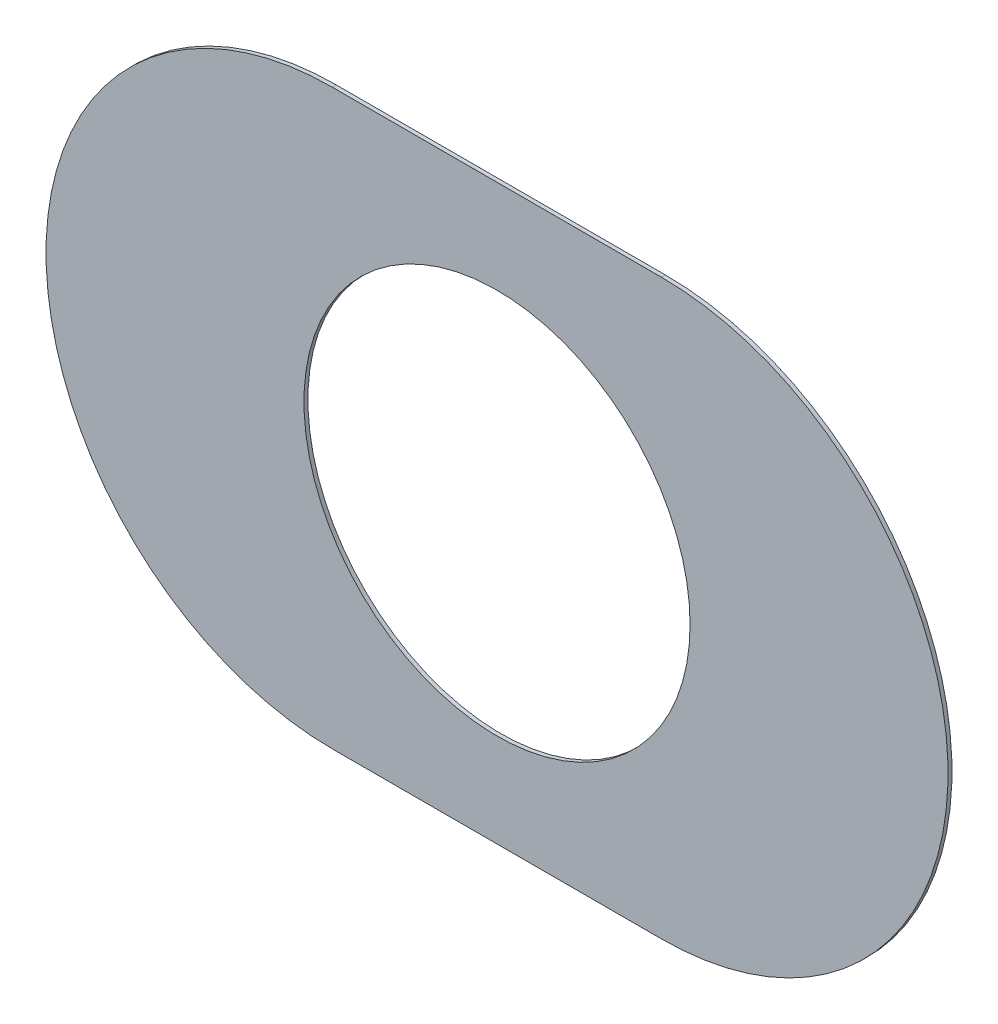
ISO-10303-21;
HEADER;
FILE_DESCRIPTION(('STEP AP214'),'2;1');
FILE_NAME('part.step','',(''),(''),'','','');
FILE_SCHEMA(('AUTOMOTIVE_DESIGN { 1 0 10303 214 1 1 1 1 }'));
ENDSEC;
DATA;
#1=APPLICATION_CONTEXT('core data for automotive mechanical design processes');
#2=APPLICATION_PROTOCOL_DEFINITION('international standard','automotive_design',2000,#1);
#3=PRODUCT_CONTEXT('',#1,'mechanical');
#4=PRODUCT('Part','Part','',(#3));
#5=PRODUCT_RELATED_PRODUCT_CATEGORY('part','',(#4));
#6=PRODUCT_DEFINITION_FORMATION('','',#4);
#7=PRODUCT_DEFINITION_CONTEXT('part definition',#1,'design');
#8=PRODUCT_DEFINITION('design','',#6,#7);
#9=PRODUCT_DEFINITION_SHAPE('','',#8);
#10=(LENGTH_UNIT() NAMED_UNIT(*) SI_UNIT(.MILLI.,.METRE.));
#11=(NAMED_UNIT(*) PLANE_ANGLE_UNIT() SI_UNIT($,.RADIAN.));
#12=(NAMED_UNIT(*) SI_UNIT($,.STERADIAN.) SOLID_ANGLE_UNIT());
#13=UNCERTAINTY_MEASURE_WITH_UNIT(LENGTH_MEASURE(1.E-05),#10,'distance_accuracy_value','');
#14=(GEOMETRIC_REPRESENTATION_CONTEXT(3) GLOBAL_UNCERTAINTY_ASSIGNED_CONTEXT((#13)) GLOBAL_UNIT_ASSIGNED_CONTEXT((#10,
#11,#12)) REPRESENTATION_CONTEXT('',''));
#15=CARTESIAN_POINT('',(0.,0.,0.));
#16=DIRECTION('',(0.,0.,1.));
#17=DIRECTION('',(1.,0.,0.));
#18=AXIS2_PLACEMENT_3D('',#15,#16,#17);
#19=CARTESIAN_POINT('',(24.3000003427268,19.6200006854535,0.));
#20=DIRECTION('',(0.,0.,1.));
#21=DIRECTION('',(1.,0.,0.));
#22=AXIS2_PLACEMENT_3D('',#19,#20,#21);
#23=PLANE('',#22);
#24=CARTESIAN_POINT('',(24.3000003427268,19.6200006854535,0.));
#25=DIRECTION('',(0.,0.,-1.));
#26=DIRECTION('',(-1.,0.,0.));
#27=AXIS2_PLACEMENT_3D('',#24,#25,#26);
#28=CIRCLE('',#27,0.49);
#29=CARTESIAN_POINT('',(24.7900003427268,19.6200006854535,0.));
#30=VERTEX_POINT('',#29);
#31=EDGE_CURVE('E74',#30,#30,#28,.T.);
#32=ORIENTED_EDGE('',*,*,#31,.T.);
#33=EDGE_LOOP('',(#32));
#34=FACE_BOUND('',#33,.T.);
#35=CARTESIAN_POINT('',(23.8825938881802,19.6200006854535,0.));
#36=DIRECTION('',(0.,0.,1.));
#37=DIRECTION('',(0.,1.,0.));
#38=AXIS2_PLACEMENT_3D('',#35,#36,#37);
#39=CIRCLE('',#38,0.727257121659981);
#40=CARTESIAN_POINT('',(23.8825938881802,20.3472578071135,0.));
#41=VERTEX_POINT('',#40);
#42=CARTESIAN_POINT('',(23.8825938881802,18.8927435637935,0.));
#43=VERTEX_POINT('',#42);
#44=EDGE_CURVE('E28',#41,#43,#39,.T.);
#45=ORIENTED_EDGE('',*,*,#44,.T.);
#46=DIRECTION('',(1.,0.,0.));
#47=VECTOR('',#46,1.);
#48=CARTESIAN_POINT('',(23.8825938881802,18.8927435637935,0.));
#49=LINE('',#48,#47);
#50=CARTESIAN_POINT('',(24.7174067972734,18.8927435637935,0.));
#51=VERTEX_POINT('',#50);
#52=EDGE_CURVE('E100',#43,#51,#49,.T.);
#53=ORIENTED_EDGE('',*,*,#52,.T.);
#54=CARTESIAN_POINT('',(24.7174067972734,19.6200006854535,0.));
#55=DIRECTION('',(0.,0.,1.));
#56=DIRECTION('',(0.,-1.,0.));
#57=AXIS2_PLACEMENT_3D('',#54,#55,#56);
#58=CIRCLE('',#57,0.727257121659981);
#59=CARTESIAN_POINT('',(24.7174067972734,20.3472578071135,0.));
#60=VERTEX_POINT('',#59);
#61=EDGE_CURVE('E96',#51,#60,#58,.T.);
#62=ORIENTED_EDGE('',*,*,#61,.T.);
#63=DIRECTION('',(-1.,0.,0.));
#64=VECTOR('',#63,1.);
#65=CARTESIAN_POINT('',(24.7174067972734,20.3472578071135,0.));
#66=LINE('',#65,#64);
#67=EDGE_CURVE('E79',#60,#41,#66,.T.);
#68=ORIENTED_EDGE('',*,*,#67,.T.);
#69=EDGE_LOOP('',(#45,#53,#62,#68));
#70=FACE_BOUND('',#69,.T.);
#71=ADVANCED_FACE('F17',(#34,#70),#23,.T.);
#72=CARTESIAN_POINT('',(24.3000003427268,19.6200006854535,-0.01));
#73=DIRECTION('',(0.,0.,1.));
#74=DIRECTION('',(1.,0.,0.));
#75=AXIS2_PLACEMENT_3D('',#72,#73,#74);
#76=PLANE('',#75);
#77=CARTESIAN_POINT('',(24.3000003427268,19.6200006854535,-0.01));
#78=DIRECTION('',(0.,0.,-1.));
#79=DIRECTION('',(-1.,0.,0.));
#80=AXIS2_PLACEMENT_3D('',#77,#78,#79);
#81=CIRCLE('',#80,0.49);
#82=CARTESIAN_POINT('',(24.7900003427268,19.6200006854535,-0.01));
#83=VERTEX_POINT('',#82);
#84=EDGE_CURVE('E88',#83,#83,#81,.T.);
#85=ORIENTED_EDGE('',*,*,#84,.F.);
#86=EDGE_LOOP('',(#85));
#87=FACE_BOUND('',#86,.T.);
#88=CARTESIAN_POINT('',(23.8825938881802,19.6200006854535,-0.01));
#89=DIRECTION('',(0.,0.,1.));
#90=DIRECTION('',(0.,1.,0.));
#91=AXIS2_PLACEMENT_3D('',#88,#89,#90);
#92=CIRCLE('',#91,0.727257121659981);
#93=CARTESIAN_POINT('',(23.8825938881802,20.3472578071135,-0.01));
#94=VERTEX_POINT('',#93);
#95=CARTESIAN_POINT('',(23.8825938881802,18.8927435637935,-0.01));
#96=VERTEX_POINT('',#95);
#97=EDGE_CURVE('E11',#94,#96,#92,.T.);
#98=ORIENTED_EDGE('',*,*,#97,.F.);
#99=DIRECTION('',(-1.,0.,0.));
#100=VECTOR('',#99,1.);
#101=CARTESIAN_POINT('',(24.7174067972734,20.3472578071135,-0.01));
#102=LINE('',#101,#100);
#103=CARTESIAN_POINT('',(24.7174067972734,20.3472578071135,-0.01));
#104=VERTEX_POINT('',#103);
#105=EDGE_CURVE('E101',#104,#94,#102,.T.);
#106=ORIENTED_EDGE('',*,*,#105,.F.);
#107=CARTESIAN_POINT('',(24.7174067972734,19.6200006854535,-0.01));
#108=DIRECTION('',(0.,0.,1.));
#109=DIRECTION('',(0.,-1.,0.));
#110=AXIS2_PLACEMENT_3D('',#107,#108,#109);
#111=CIRCLE('',#110,0.727257121659981);
#112=CARTESIAN_POINT('',(24.7174067972734,18.8927435637935,-0.01));
#113=VERTEX_POINT('',#112);
#114=EDGE_CURVE('E95',#113,#104,#111,.T.);
#115=ORIENTED_EDGE('',*,*,#114,.F.);
#116=DIRECTION('',(1.,0.,0.));
#117=VECTOR('',#116,1.);
#118=CARTESIAN_POINT('',(23.8825938881802,18.8927435637935,-0.01));
#119=LINE('',#118,#117);
#120=EDGE_CURVE('E108',#96,#113,#119,.T.);
#121=ORIENTED_EDGE('',*,*,#120,.F.);
#122=EDGE_LOOP('',(#98,#106,#115,#121));
#123=FACE_BOUND('',#122,.T.);
#124=ADVANCED_FACE('F182',(#87,#123),#76,.F.);
#125=CARTESIAN_POINT('',(23.8825938881802,19.6200006854535,0.));
#126=DIRECTION('',(0.,0.,1.));
#127=DIRECTION('',(0.,1.,0.));
#128=AXIS2_PLACEMENT_3D('',#125,#126,#127);
#129=CYLINDRICAL_SURFACE('',#128,0.727257121659981);
#130=ORIENTED_EDGE('',*,*,#44,.F.);
#131=DIRECTION('',(0.,0.,-1.));
#132=VECTOR('',#131,1.);
#133=CARTESIAN_POINT('',(23.8825938881802,20.3472578071135,0.));
#134=LINE('',#133,#132);
#135=EDGE_CURVE('E105',#41,#94,#134,.T.);
#136=ORIENTED_EDGE('',*,*,#135,.T.);
#137=ORIENTED_EDGE('',*,*,#97,.T.);
#138=DIRECTION('',(0.,0.,-1.));
#139=VECTOR('',#138,1.);
#140=CARTESIAN_POINT('',(23.8825938881802,18.8927435637935,0.));
#141=LINE('',#140,#139);
#142=EDGE_CURVE('E21',#43,#96,#141,.T.);
#143=ORIENTED_EDGE('',*,*,#142,.F.);
#144=EDGE_LOOP('',(#130,#136,#137,#143));
#145=FACE_BOUND('',#144,.T.);
#146=ADVANCED_FACE('F130',(#145),#129,.T.);
#147=CARTESIAN_POINT('',(23.8825938881802,18.8927435637935,0.));
#148=DIRECTION('',(0.,1.,0.));
#149=DIRECTION('',(1.,0.,0.));
#150=AXIS2_PLACEMENT_3D('',#147,#148,#149);
#151=PLANE('',#150);
#152=ORIENTED_EDGE('',*,*,#52,.F.);
#153=ORIENTED_EDGE('',*,*,#142,.T.);
#154=ORIENTED_EDGE('',*,*,#120,.T.);
#155=DIRECTION('',(0.,0.,-1.));
#156=VECTOR('',#155,1.);
#157=CARTESIAN_POINT('',(24.7174067972734,18.8927435637935,0.));
#158=LINE('',#157,#156);
#159=EDGE_CURVE('E91',#51,#113,#158,.T.);
#160=ORIENTED_EDGE('',*,*,#159,.F.);
#161=EDGE_LOOP('',(#152,#153,#154,#160));
#162=FACE_BOUND('',#161,.T.);
#163=ADVANCED_FACE('F19',(#162),#151,.F.);
#164=CARTESIAN_POINT('',(24.7174067972734,19.6200006854535,0.));
#165=DIRECTION('',(0.,0.,1.));
#166=DIRECTION('',(0.,-1.,0.));
#167=AXIS2_PLACEMENT_3D('',#164,#165,#166);
#168=CYLINDRICAL_SURFACE('',#167,0.727257121659981);
#169=ORIENTED_EDGE('',*,*,#61,.F.);
#170=ORIENTED_EDGE('',*,*,#159,.T.);
#171=ORIENTED_EDGE('',*,*,#114,.T.);
#172=DIRECTION('',(0.,0.,-1.));
#173=VECTOR('',#172,1.);
#174=CARTESIAN_POINT('',(24.7174067972734,20.3472578071135,0.));
#175=LINE('',#174,#173);
#176=EDGE_CURVE('E85',#60,#104,#175,.T.);
#177=ORIENTED_EDGE('',*,*,#176,.F.);
#178=EDGE_LOOP('',(#169,#170,#171,#177));
#179=FACE_BOUND('',#178,.T.);
#180=ADVANCED_FACE('F139',(#179),#168,.T.);
#181=CARTESIAN_POINT('',(24.7174067972734,20.3472578071135,0.));
#182=DIRECTION('',(0.,-1.,0.));
#183=DIRECTION('',(0.,0.,-1.));
#184=AXIS2_PLACEMENT_3D('',#181,#182,#183);
#185=PLANE('',#184);
#186=ORIENTED_EDGE('',*,*,#67,.F.);
#187=ORIENTED_EDGE('',*,*,#176,.T.);
#188=ORIENTED_EDGE('',*,*,#105,.T.);
#189=ORIENTED_EDGE('',*,*,#135,.F.);
#190=EDGE_LOOP('',(#186,#187,#188,#189));
#191=FACE_BOUND('',#190,.T.);
#192=ADVANCED_FACE('F134',(#191),#185,.F.);
#193=CARTESIAN_POINT('',(24.3000003427268,19.6200006854535,0.));
#194=DIRECTION('',(0.,0.,1.));
#195=DIRECTION('',(-1.,0.,0.));
#196=AXIS2_PLACEMENT_3D('',#193,#194,#195);
#197=CYLINDRICAL_SURFACE('',#196,0.49);
#198=ORIENTED_EDGE('',*,*,#84,.T.);
#199=DIRECTION('',(0.,0.,1.));
#200=VECTOR('',#199,1.);
#201=CARTESIAN_POINT('',(24.7900003427268,19.6200006854535,0.));
#202=LINE('',#201,#200);
#203=EDGE_CURVE('E80',#83,#30,#202,.T.);
#204=ORIENTED_EDGE('',*,*,#203,.T.);
#205=ORIENTED_EDGE('',*,*,#31,.F.);
#206=ORIENTED_EDGE('',*,*,#203,.F.);
#207=EDGE_LOOP('',(#198,#204,#205,#206));
#208=FACE_BOUND('',#207,.T.);
#209=ADVANCED_FACE('F195',(#208),#197,.F.);
#210=CLOSED_SHELL('',(#71,#124,#146,#163,#180,#192,#209));
#211=MANIFOLD_SOLID_BREP('B1',#210);
#212=ADVANCED_BREP_SHAPE_REPRESENTATION('',(#18,#211),#14);
#213=SHAPE_DEFINITION_REPRESENTATION(#9,#212);
ENDSEC;
END-ISO-10303-21;
